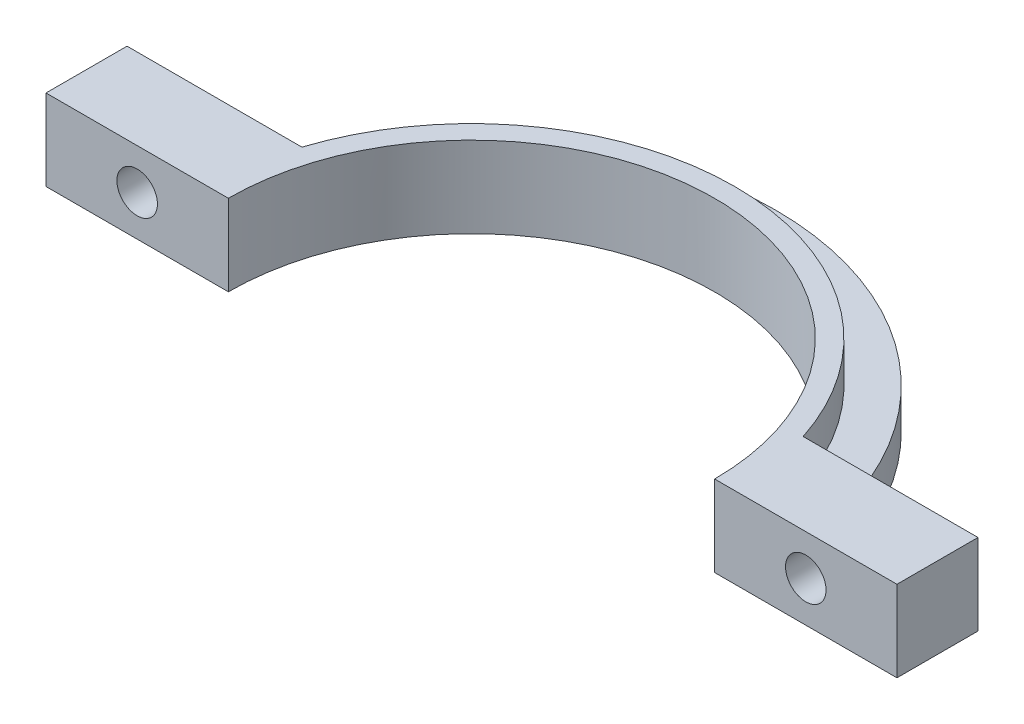
ISO-10303-21;
HEADER;
FILE_DESCRIPTION(('STEP AP214'),'2;1');
FILE_NAME('part.step','',(''),(''),'','','');
FILE_SCHEMA(('AUTOMOTIVE_DESIGN { 1 0 10303 214 1 1 1 1 }'));
ENDSEC;
DATA;
#1=APPLICATION_CONTEXT('core data for automotive mechanical design processes');
#2=APPLICATION_PROTOCOL_DEFINITION('international standard','automotive_design',2000,#1);
#3=PRODUCT_CONTEXT('',#1,'mechanical');
#4=PRODUCT('Part','Part','',(#3));
#5=PRODUCT_RELATED_PRODUCT_CATEGORY('part','',(#4));
#6=PRODUCT_DEFINITION_FORMATION('','',#4);
#7=PRODUCT_DEFINITION_CONTEXT('part definition',#1,'design');
#8=PRODUCT_DEFINITION('design','',#6,#7);
#9=PRODUCT_DEFINITION_SHAPE('','',#8);
#10=(LENGTH_UNIT() NAMED_UNIT(*) SI_UNIT(.MILLI.,.METRE.));
#11=(NAMED_UNIT(*) PLANE_ANGLE_UNIT() SI_UNIT($,.RADIAN.));
#12=(NAMED_UNIT(*) SI_UNIT($,.STERADIAN.) SOLID_ANGLE_UNIT());
#13=UNCERTAINTY_MEASURE_WITH_UNIT(LENGTH_MEASURE(1.E-05),#10,'distance_accuracy_value','');
#14=(GEOMETRIC_REPRESENTATION_CONTEXT(3) GLOBAL_UNCERTAINTY_ASSIGNED_CONTEXT((#13)) GLOBAL_UNIT_ASSIGNED_CONTEXT((#10,
#11,#12)) REPRESENTATION_CONTEXT('',''));
#15=CARTESIAN_POINT('',(0.,0.,0.));
#16=DIRECTION('',(0.,0.,1.));
#17=DIRECTION('',(1.,0.,0.));
#18=AXIS2_PLACEMENT_3D('',#15,#16,#17);
#19=CARTESIAN_POINT('',(0.,0.,0.));
#20=DIRECTION('',(0.,1.,0.));
#21=DIRECTION('',(0.,0.,1.));
#22=AXIS2_PLACEMENT_3D('',#19,#20,#21);
#23=PLANE('',#22);
#24=DIRECTION('',(-1.,0.,0.));
#25=VECTOR('',#24,1.);
#26=CARTESIAN_POINT('',(0.,0.,-9.99999999999999));
#27=LINE('',#26,#25);
#28=CARTESIAN_POINT('',(34.8064641982667,0.,-10.));
#29=VERTEX_POINT('',#28);
#30=CARTESIAN_POINT('',(28.2842712474619,0.,-10.));
#31=VERTEX_POINT('',#30);
#32=EDGE_CURVE('E191',#29,#31,#27,.T.);
#33=ORIENTED_EDGE('',*,*,#32,.F.);
#34=DIRECTION('',(0.,0.,1.));
#35=VECTOR('',#34,1.);
#36=CARTESIAN_POINT('',(34.8064641982667,0.,0.));
#37=LINE('',#36,#35);
#38=CARTESIAN_POINT('',(34.8064641982666,0.,-13.955645811455));
#39=VERTEX_POINT('',#38);
#40=EDGE_CURVE('E187',#39,#29,#37,.T.);
#41=ORIENTED_EDGE('',*,*,#40,.F.);
#42=CARTESIAN_POINT('',(0.,0.,0.));
#43=DIRECTION('',(0.,1.,0.));
#44=DIRECTION('',(0.,0.,1.));
#45=AXIS2_PLACEMENT_3D('',#42,#43,#44);
#46=CIRCLE('',#45,37.5);
#47=CARTESIAN_POINT('',(36.1420807370024,0.,-10.));
#48=VERTEX_POINT('',#47);
#49=EDGE_CURVE('E215',#48,#39,#46,.T.);
#50=ORIENTED_EDGE('',*,*,#49,.F.);
#51=DIRECTION('',(-1.,0.,0.));
#52=VECTOR('',#51,1.);
#53=CARTESIAN_POINT('',(0.,0.,-9.99999999999998));
#54=LINE('',#53,#52);
#55=CARTESIAN_POINT('',(52.5,0.,-10.));
#56=VERTEX_POINT('',#55);
#57=EDGE_CURVE('E289',#56,#48,#54,.T.);
#58=ORIENTED_EDGE('',*,*,#57,.F.);
#59=DIRECTION('',(0.,0.,-1.));
#60=VECTOR('',#59,1.);
#61=CARTESIAN_POINT('',(52.5,0.,0.));
#62=LINE('',#61,#60);
#63=CARTESIAN_POINT('',(52.5,0.,0.));
#64=VERTEX_POINT('',#63);
#65=EDGE_CURVE('E286',#64,#56,#62,.T.);
#66=ORIENTED_EDGE('',*,*,#65,.F.);
#67=DIRECTION('',(1.,0.,0.));
#68=VECTOR('',#67,1.);
#69=CARTESIAN_POINT('',(0.,0.,0.));
#70=LINE('',#69,#68);
#71=CARTESIAN_POINT('',(30.,0.,0.));
#72=VERTEX_POINT('',#71);
#73=EDGE_CURVE('E241',#72,#64,#70,.T.);
#74=ORIENTED_EDGE('',*,*,#73,.F.);
#75=CARTESIAN_POINT('',(0.,0.,0.));
#76=DIRECTION('',(0.,1.,0.));
#77=DIRECTION('',(0.,0.,1.));
#78=AXIS2_PLACEMENT_3D('',#75,#76,#77);
#79=CIRCLE('',#78,30.);
#80=EDGE_CURVE('E258',#72,#31,#79,.T.);
#81=ORIENTED_EDGE('',*,*,#80,.T.);
#82=EDGE_LOOP('',(#33,#41,#50,#58,#66,#74,#81));
#83=FACE_BOUND('',#82,.T.);
#84=ADVANCED_FACE('F51',(#83),#23,.F.);
#85=CARTESIAN_POINT('',(0.,10.,-9.99999999999998));
#86=DIRECTION('',(0.,0.,1.));
#87=DIRECTION('',(1.,0.,0.));
#88=AXIS2_PLACEMENT_3D('',#85,#86,#87);
#89=PLANE('',#88);
#90=CARTESIAN_POINT('',(41.25,5.,-10.));
#91=DIRECTION('',(0.,0.,1.));
#92=DIRECTION('',(1.,0.,0.));
#93=AXIS2_PLACEMENT_3D('',#90,#91,#92);
#94=CIRCLE('',#93,2.5);
#95=CARTESIAN_POINT('',(43.75,5.,-10.));
#96=VERTEX_POINT('',#95);
#97=EDGE_CURVE('E236',#96,#96,#94,.T.);
#98=ORIENTED_EDGE('',*,*,#97,.T.);
#99=EDGE_LOOP('',(#98));
#100=FACE_BOUND('',#99,.T.);
#101=DIRECTION('',(0.,-1.,0.));
#102=VECTOR('',#101,1.);
#103=CARTESIAN_POINT('',(36.1420807370024,5.,-10.));
#104=LINE('',#103,#102);
#105=CARTESIAN_POINT('',(36.1420807370024,5.,-10.));
#106=VERTEX_POINT('',#105);
#107=EDGE_CURVE('E225',#106,#48,#104,.T.);
#108=ORIENTED_EDGE('',*,*,#107,.F.);
#109=DIRECTION('',(-1.,0.,0.));
#110=VECTOR('',#109,1.);
#111=CARTESIAN_POINT('',(0.,5.,-9.99999999999998));
#112=LINE('',#111,#110);
#113=CARTESIAN_POINT('',(30.9232921921325,5.,-10.));
#114=VERTEX_POINT('',#113);
#115=EDGE_CURVE('E233',#106,#114,#112,.T.);
#116=ORIENTED_EDGE('',*,*,#115,.T.);
#117=DIRECTION('',(0.,-1.,0.));
#118=VECTOR('',#117,1.);
#119=CARTESIAN_POINT('',(30.9232921921325,10.,-10.));
#120=LINE('',#119,#118);
#121=CARTESIAN_POINT('',(30.9232921921325,10.,-10.));
#122=VERTEX_POINT('',#121);
#123=EDGE_CURVE('E323',#122,#114,#120,.T.);
#124=ORIENTED_EDGE('',*,*,#123,.F.);
#125=DIRECTION('',(-1.,0.,0.));
#126=VECTOR('',#125,1.);
#127=CARTESIAN_POINT('',(0.,10.,-9.99999999999998));
#128=LINE('',#127,#126);
#129=CARTESIAN_POINT('',(52.5,10.,-10.));
#130=VERTEX_POINT('',#129);
#131=EDGE_CURVE('E261',#130,#122,#128,.T.);
#132=ORIENTED_EDGE('',*,*,#131,.F.);
#133=DIRECTION('',(0.,-1.,0.));
#134=VECTOR('',#133,1.);
#135=CARTESIAN_POINT('',(52.5,10.,-10.));
#136=LINE('',#135,#134);
#137=EDGE_CURVE('E327',#130,#56,#136,.T.);
#138=ORIENTED_EDGE('',*,*,#137,.T.);
#139=ORIENTED_EDGE('',*,*,#57,.T.);
#140=EDGE_LOOP('',(#108,#116,#124,#132,#138,#139));
#141=FACE_BOUND('',#140,.T.);
#142=ADVANCED_FACE('F376',(#100,#141),#89,.F.);
#143=CARTESIAN_POINT('',(0.,10.,-10.));
#144=DIRECTION('',(0.,0.,-1.));
#145=DIRECTION('',(-1.,0.,0.));
#146=AXIS2_PLACEMENT_3D('',#143,#144,#145);
#147=PLANE('',#146);
#148=CARTESIAN_POINT('',(-41.25,5.,-10.));
#149=DIRECTION('',(0.,0.,1.));
#150=DIRECTION('',(1.,0.,0.));
#151=AXIS2_PLACEMENT_3D('',#148,#149,#150);
#152=CIRCLE('',#151,2.5);
#153=CARTESIAN_POINT('',(-38.75,5.,-10.));
#154=VERTEX_POINT('',#153);
#155=EDGE_CURVE('E237',#154,#154,#152,.T.);
#156=ORIENTED_EDGE('',*,*,#155,.T.);
#157=EDGE_LOOP('',(#156));
#158=FACE_BOUND('',#157,.T.);
#159=DIRECTION('',(1.,0.,0.));
#160=VECTOR('',#159,1.);
#161=CARTESIAN_POINT('',(0.,5.,-10.));
#162=LINE('',#161,#160);
#163=CARTESIAN_POINT('',(-36.1420807370024,5.,-10.));
#164=VERTEX_POINT('',#163);
#165=CARTESIAN_POINT('',(-30.9232921921325,5.,-10.));
#166=VERTEX_POINT('',#165);
#167=EDGE_CURVE('E229',#164,#166,#162,.T.);
#168=ORIENTED_EDGE('',*,*,#167,.F.);
#169=DIRECTION('',(0.,-1.,0.));
#170=VECTOR('',#169,1.);
#171=CARTESIAN_POINT('',(-36.1420807370024,5.,-10.));
#172=LINE('',#171,#170);
#173=CARTESIAN_POINT('',(-36.1420807370024,0.,-10.));
#174=VERTEX_POINT('',#173);
#175=EDGE_CURVE('E219',#164,#174,#172,.T.);
#176=ORIENTED_EDGE('',*,*,#175,.T.);
#177=DIRECTION('',(1.,0.,0.));
#178=VECTOR('',#177,1.);
#179=CARTESIAN_POINT('',(0.,0.,-10.));
#180=LINE('',#179,#178);
#181=CARTESIAN_POINT('',(-52.5,0.,-10.));
#182=VERTEX_POINT('',#181);
#183=EDGE_CURVE('E292',#182,#174,#180,.T.);
#184=ORIENTED_EDGE('',*,*,#183,.F.);
#185=DIRECTION('',(0.,-1.,0.));
#186=VECTOR('',#185,1.);
#187=CARTESIAN_POINT('',(-52.5,10.,-10.));
#188=LINE('',#187,#186);
#189=CARTESIAN_POINT('',(-52.5,10.,-10.));
#190=VERTEX_POINT('',#189);
#191=EDGE_CURVE('E316',#190,#182,#188,.T.);
#192=ORIENTED_EDGE('',*,*,#191,.F.);
#193=DIRECTION('',(1.,0.,0.));
#194=VECTOR('',#193,1.);
#195=CARTESIAN_POINT('',(0.,10.,-10.));
#196=LINE('',#195,#194);
#197=CARTESIAN_POINT('',(-30.9232921921325,10.,-10.));
#198=VERTEX_POINT('',#197);
#199=EDGE_CURVE('E267',#190,#198,#196,.T.);
#200=ORIENTED_EDGE('',*,*,#199,.T.);
#201=DIRECTION('',(0.,-1.,0.));
#202=VECTOR('',#201,1.);
#203=CARTESIAN_POINT('',(-30.9232921921325,10.,-10.));
#204=LINE('',#203,#202);
#205=EDGE_CURVE('E319',#198,#166,#204,.T.);
#206=ORIENTED_EDGE('',*,*,#205,.T.);
#207=EDGE_LOOP('',(#168,#176,#184,#192,#200,#206));
#208=FACE_BOUND('',#207,.T.);
#209=ADVANCED_FACE('F384',(#158,#208),#147,.T.);
#210=CARTESIAN_POINT('',(0.,10.,0.));
#211=DIRECTION('',(0.,0.,-1.));
#212=DIRECTION('',(-1.,0.,0.));
#213=AXIS2_PLACEMENT_3D('',#210,#211,#212);
#214=PLANE('',#213);
#215=CARTESIAN_POINT('',(41.25,5.,0.));
#216=DIRECTION('',(0.,0.,1.));
#217=DIRECTION('',(1.,0.,0.));
#218=AXIS2_PLACEMENT_3D('',#215,#216,#217);
#219=CIRCLE('',#218,2.5);
#220=CARTESIAN_POINT('',(43.75,5.,0.));
#221=VERTEX_POINT('',#220);
#222=EDGE_CURVE('E246',#221,#221,#219,.T.);
#223=ORIENTED_EDGE('',*,*,#222,.F.);
#224=EDGE_LOOP('',(#223));
#225=FACE_BOUND('',#224,.T.);
#226=ORIENTED_EDGE('',*,*,#73,.T.);
#227=DIRECTION('',(0.,-1.,0.));
#228=VECTOR('',#227,1.);
#229=CARTESIAN_POINT('',(52.5,10.,0.));
#230=LINE('',#229,#228);
#231=CARTESIAN_POINT('',(52.5,10.,0.));
#232=VERTEX_POINT('',#231);
#233=EDGE_CURVE('E331',#232,#64,#230,.T.);
#234=ORIENTED_EDGE('',*,*,#233,.F.);
#235=DIRECTION('',(1.,0.,0.));
#236=VECTOR('',#235,1.);
#237=CARTESIAN_POINT('',(0.,10.,0.));
#238=LINE('',#237,#236);
#239=CARTESIAN_POINT('',(30.,10.,0.));
#240=VERTEX_POINT('',#239);
#241=EDGE_CURVE('E253',#240,#232,#238,.T.);
#242=ORIENTED_EDGE('',*,*,#241,.F.);
#243=DIRECTION('',(0.,-1.,0.));
#244=VECTOR('',#243,1.);
#245=CARTESIAN_POINT('',(30.,10.,0.));
#246=LINE('',#245,#244);
#247=EDGE_CURVE('E283',#240,#72,#246,.T.);
#248=ORIENTED_EDGE('',*,*,#247,.T.);
#249=EDGE_LOOP('',(#226,#234,#242,#248));
#250=FACE_BOUND('',#249,.T.);
#251=ADVANCED_FACE('F480',(#225,#250),#214,.F.);
#252=CARTESIAN_POINT('',(52.5,10.,0.));
#253=DIRECTION('',(-1.,0.,0.));
#254=DIRECTION('',(0.,0.,1.));
#255=AXIS2_PLACEMENT_3D('',#252,#253,#254);
#256=PLANE('',#255);
#257=ORIENTED_EDGE('',*,*,#65,.T.);
#258=ORIENTED_EDGE('',*,*,#137,.F.);
#259=DIRECTION('',(0.,0.,-1.));
#260=VECTOR('',#259,1.);
#261=CARTESIAN_POINT('',(52.5,10.,0.));
#262=LINE('',#261,#260);
#263=EDGE_CURVE('E257',#232,#130,#262,.T.);
#264=ORIENTED_EDGE('',*,*,#263,.F.);
#265=ORIENTED_EDGE('',*,*,#233,.T.);
#266=EDGE_LOOP('',(#257,#258,#264,#265));
#267=FACE_BOUND('',#266,.T.);
#268=ADVANCED_FACE('F477',(#267),#256,.F.);
#269=CARTESIAN_POINT('',(0.,10.,0.));
#270=DIRECTION('',(0.,-1.,0.));
#271=DIRECTION('',(0.,0.,-1.));
#272=AXIS2_PLACEMENT_3D('',#269,#270,#271);
#273=CYLINDRICAL_SURFACE('',#272,32.5);
#274=ORIENTED_EDGE('',*,*,#123,.T.);
#275=CARTESIAN_POINT('',(0.,5.,0.));
#276=DIRECTION('',(0.,1.,0.));
#277=DIRECTION('',(0.,0.,1.));
#278=AXIS2_PLACEMENT_3D('',#275,#276,#277);
#279=CIRCLE('',#278,32.5);
#280=EDGE_CURVE('E211',#114,#166,#279,.T.);
#281=ORIENTED_EDGE('',*,*,#280,.T.);
#282=ORIENTED_EDGE('',*,*,#205,.F.);
#283=CARTESIAN_POINT('',(0.,10.,0.));
#284=DIRECTION('',(0.,1.,0.));
#285=DIRECTION('',(0.,0.,1.));
#286=AXIS2_PLACEMENT_3D('',#283,#284,#285);
#287=CIRCLE('',#286,32.5);
#288=EDGE_CURVE('E264',#122,#198,#287,.T.);
#289=ORIENTED_EDGE('',*,*,#288,.F.);
#290=EDGE_LOOP('',(#274,#281,#282,#289));
#291=FACE_BOUND('',#290,.T.);
#292=ADVANCED_FACE('F470',(#291),#273,.T.);
#293=CARTESIAN_POINT('',(-52.5,10.,0.));
#294=DIRECTION('',(-1.,0.,0.));
#295=DIRECTION('',(0.,0.,1.));
#296=AXIS2_PLACEMENT_3D('',#293,#294,#295);
#297=PLANE('',#296);
#298=DIRECTION('',(0.,0.,-1.));
#299=VECTOR('',#298,1.);
#300=CARTESIAN_POINT('',(-52.5,0.,0.));
#301=LINE('',#300,#299);
#302=CARTESIAN_POINT('',(-52.5,0.,0.));
#303=VERTEX_POINT('',#302);
#304=EDGE_CURVE('E295',#303,#182,#301,.T.);
#305=ORIENTED_EDGE('',*,*,#304,.F.);
#306=DIRECTION('',(0.,-1.,0.));
#307=VECTOR('',#306,1.);
#308=CARTESIAN_POINT('',(-52.5,10.,0.));
#309=LINE('',#308,#307);
#310=CARTESIAN_POINT('',(-52.5,10.,0.));
#311=VERTEX_POINT('',#310);
#312=EDGE_CURVE('E312',#311,#303,#309,.T.);
#313=ORIENTED_EDGE('',*,*,#312,.F.);
#314=DIRECTION('',(0.,0.,-1.));
#315=VECTOR('',#314,1.);
#316=CARTESIAN_POINT('',(-52.5,10.,0.));
#317=LINE('',#316,#315);
#318=EDGE_CURVE('E271',#311,#190,#317,.T.);
#319=ORIENTED_EDGE('',*,*,#318,.T.);
#320=ORIENTED_EDGE('',*,*,#191,.T.);
#321=EDGE_LOOP('',(#305,#313,#319,#320));
#322=FACE_BOUND('',#321,.T.);
#323=ADVANCED_FACE('F461',(#322),#297,.T.);
#324=CARTESIAN_POINT('',(0.,10.,0.));
#325=DIRECTION('',(0.,0.,1.));
#326=DIRECTION('',(1.,0.,0.));
#327=AXIS2_PLACEMENT_3D('',#324,#325,#326);
#328=PLANE('',#327);
#329=ORIENTED_EDGE('',*,*,#312,.T.);
#330=DIRECTION('',(-1.,0.,0.));
#331=VECTOR('',#330,1.);
#332=CARTESIAN_POINT('',(0.,0.,0.));
#333=LINE('',#332,#331);
#334=CARTESIAN_POINT('',(-30.,0.,0.));
#335=VERTEX_POINT('',#334);
#336=EDGE_CURVE('E299',#335,#303,#333,.T.);
#337=ORIENTED_EDGE('',*,*,#336,.F.);
#338=DIRECTION('',(0.,-1.,0.));
#339=VECTOR('',#338,1.);
#340=CARTESIAN_POINT('',(-30.,10.,0.));
#341=LINE('',#340,#339);
#342=CARTESIAN_POINT('',(-30.,10.,0.));
#343=VERTEX_POINT('',#342);
#344=EDGE_CURVE('E308',#343,#335,#341,.T.);
#345=ORIENTED_EDGE('',*,*,#344,.F.);
#346=DIRECTION('',(-1.,0.,0.));
#347=VECTOR('',#346,1.);
#348=CARTESIAN_POINT('',(0.,10.,0.));
#349=LINE('',#348,#347);
#350=EDGE_CURVE('E275',#343,#311,#349,.T.);
#351=ORIENTED_EDGE('',*,*,#350,.T.);
#352=EDGE_LOOP('',(#329,#337,#345,#351));
#353=FACE_BOUND('',#352,.T.);
#354=CARTESIAN_POINT('',(-41.25,5.,0.));
#355=DIRECTION('',(0.,0.,1.));
#356=DIRECTION('',(1.,0.,0.));
#357=AXIS2_PLACEMENT_3D('',#354,#355,#356);
#358=CIRCLE('',#357,2.5);
#359=CARTESIAN_POINT('',(-38.75,5.,0.));
#360=VERTEX_POINT('',#359);
#361=EDGE_CURVE('E242',#360,#360,#358,.T.);
#362=ORIENTED_EDGE('',*,*,#361,.F.);
#363=EDGE_LOOP('',(#362));
#364=FACE_BOUND('',#363,.T.);
#365=ADVANCED_FACE('F406',(#353,#364),#328,.T.);
#366=CARTESIAN_POINT('',(0.,10.,0.));
#367=DIRECTION('',(0.,-1.,0.));
#368=DIRECTION('',(0.,0.,-1.));
#369=AXIS2_PLACEMENT_3D('',#366,#367,#368);
#370=CYLINDRICAL_SURFACE('',#369,30.);
#371=ORIENTED_EDGE('',*,*,#80,.F.);
#372=ORIENTED_EDGE('',*,*,#247,.F.);
#373=CARTESIAN_POINT('',(0.,10.,0.));
#374=DIRECTION('',(0.,1.,0.));
#375=DIRECTION('',(0.,0.,1.));
#376=AXIS2_PLACEMENT_3D('',#373,#374,#375);
#377=CIRCLE('',#376,30.);
#378=EDGE_CURVE('E279',#240,#343,#377,.T.);
#379=ORIENTED_EDGE('',*,*,#378,.T.);
#380=ORIENTED_EDGE('',*,*,#344,.T.);
#381=EDGE_CURVE('E302',#31,#335,#79,.T.);
#382=ORIENTED_EDGE('',*,*,#381,.F.);
#383=EDGE_LOOP('',(#371,#372,#379,#380,#382));
#384=FACE_BOUND('',#383,.T.);
#385=ADVANCED_FACE('F401',(#384),#370,.F.);
#386=CARTESIAN_POINT('',(0.,10.,0.));
#387=DIRECTION('',(0.,1.,0.));
#388=DIRECTION('',(0.,0.,1.));
#389=AXIS2_PLACEMENT_3D('',#386,#387,#388);
#390=PLANE('',#389);
#391=ORIENTED_EDGE('',*,*,#241,.T.);
#392=ORIENTED_EDGE('',*,*,#263,.T.);
#393=ORIENTED_EDGE('',*,*,#131,.T.);
#394=ORIENTED_EDGE('',*,*,#288,.T.);
#395=ORIENTED_EDGE('',*,*,#199,.F.);
#396=ORIENTED_EDGE('',*,*,#318,.F.);
#397=ORIENTED_EDGE('',*,*,#350,.F.);
#398=ORIENTED_EDGE('',*,*,#378,.F.);
#399=EDGE_LOOP('',(#391,#392,#393,#394,#395,#396,#397,#398));
#400=FACE_BOUND('',#399,.T.);
#401=ADVANCED_FACE('F392',(#400),#390,.T.);
#402=EDGE_CURVE('E184',#39,#174,#46,.T.);
#403=ORIENTED_EDGE('',*,*,#402,.F.);
#404=DIRECTION('',(-1.,0.,0.));
#405=VECTOR('',#404,1.);
#406=CARTESIAN_POINT('',(0.,0.,-13.955645811455));
#407=LINE('',#406,#405);
#408=CARTESIAN_POINT('',(28.2842712474619,0.,-13.955645811455));
#409=VERTEX_POINT('',#408);
#410=EDGE_CURVE('E170',#39,#409,#407,.T.);
#411=ORIENTED_EDGE('',*,*,#410,.T.);
#412=DIRECTION('',(0.,0.,-1.));
#413=VECTOR('',#412,1.);
#414=CARTESIAN_POINT('',(28.2842712474619,0.,0.));
#415=LINE('',#414,#413);
#416=EDGE_CURVE('E181',#31,#409,#415,.T.);
#417=ORIENTED_EDGE('',*,*,#416,.F.);
#418=ORIENTED_EDGE('',*,*,#381,.T.);
#419=ORIENTED_EDGE('',*,*,#336,.T.);
#420=ORIENTED_EDGE('',*,*,#304,.T.);
#421=ORIENTED_EDGE('',*,*,#183,.T.);
#422=EDGE_LOOP('',(#403,#411,#417,#418,#419,#420,#421));
#423=FACE_BOUND('',#422,.T.);
#424=ADVANCED_FACE('F180',(#423),#23,.F.);
#425=CARTESIAN_POINT('',(-41.25,5.,-10.));
#426=DIRECTION('',(0.,0.,1.));
#427=DIRECTION('',(1.,0.,0.));
#428=AXIS2_PLACEMENT_3D('',#425,#426,#427);
#429=CYLINDRICAL_SURFACE('',#428,2.5);
#430=ORIENTED_EDGE('',*,*,#155,.F.);
#431=EDGE_LOOP('',(#430));
#432=FACE_BOUND('',#431,.T.);
#433=ORIENTED_EDGE('',*,*,#361,.T.);
#434=EDGE_LOOP('',(#433));
#435=FACE_BOUND('',#434,.T.);
#436=ADVANCED_FACE('F391',(#432,#435),#429,.F.);
#437=CARTESIAN_POINT('',(41.25,5.,-10.));
#438=DIRECTION('',(0.,0.,1.));
#439=DIRECTION('',(1.,0.,0.));
#440=AXIS2_PLACEMENT_3D('',#437,#438,#439);
#441=CYLINDRICAL_SURFACE('',#440,2.5);
#442=ORIENTED_EDGE('',*,*,#97,.F.);
#443=EDGE_LOOP('',(#442));
#444=FACE_BOUND('',#443,.T.);
#445=ORIENTED_EDGE('',*,*,#222,.T.);
#446=EDGE_LOOP('',(#445));
#447=FACE_BOUND('',#446,.T.);
#448=ADVANCED_FACE('F397',(#444,#447),#441,.F.);
#449=CARTESIAN_POINT('',(0.,5.,0.));
#450=DIRECTION('',(0.,1.,0.));
#451=DIRECTION('',(0.,0.,1.));
#452=AXIS2_PLACEMENT_3D('',#449,#450,#451);
#453=PLANE('',#452);
#454=ORIENTED_EDGE('',*,*,#115,.F.);
#455=CARTESIAN_POINT('',(0.,5.,0.));
#456=DIRECTION('',(0.,1.,0.));
#457=DIRECTION('',(0.,0.,1.));
#458=AXIS2_PLACEMENT_3D('',#455,#456,#457);
#459=CIRCLE('',#458,37.5);
#460=EDGE_CURVE('E214',#106,#164,#459,.T.);
#461=ORIENTED_EDGE('',*,*,#460,.T.);
#462=ORIENTED_EDGE('',*,*,#167,.T.);
#463=ORIENTED_EDGE('',*,*,#280,.F.);
#464=EDGE_LOOP('',(#454,#461,#462,#463));
#465=FACE_BOUND('',#464,.T.);
#466=ADVANCED_FACE('F410',(#465),#453,.T.);
#467=CARTESIAN_POINT('',(0.,5.,0.));
#468=DIRECTION('',(0.,-1.,0.));
#469=DIRECTION('',(0.,0.,-1.));
#470=AXIS2_PLACEMENT_3D('',#467,#468,#469);
#471=CYLINDRICAL_SURFACE('',#470,37.5);
#472=ORIENTED_EDGE('',*,*,#460,.F.);
#473=ORIENTED_EDGE('',*,*,#107,.T.);
#474=ORIENTED_EDGE('',*,*,#49,.T.);
#475=ORIENTED_EDGE('',*,*,#402,.T.);
#476=ORIENTED_EDGE('',*,*,#175,.F.);
#477=EDGE_LOOP('',(#472,#473,#474,#475,#476));
#478=FACE_BOUND('',#477,.T.);
#479=ADVANCED_FACE('F413',(#478),#471,.T.);
#480=CARTESIAN_POINT('',(0.,-10.,-9.99999999999999));
#481=DIRECTION('',(0.,0.,-1.));
#482=DIRECTION('',(-1.,0.,0.));
#483=AXIS2_PLACEMENT_3D('',#480,#481,#482);
#484=PLANE('',#483);
#485=CARTESIAN_POINT('',(31.5453677228643,-6.,-10.));
#486=DIRECTION('',(0.,0.,-1.));
#487=DIRECTION('',(-1.,0.,0.));
#488=AXIS2_PLACEMENT_3D('',#485,#486,#487);
#489=CIRCLE('',#488,2.);
#490=CARTESIAN_POINT('',(29.5453677228643,-6.,-10.));
#491=VERTEX_POINT('',#490);
#492=EDGE_CURVE('E195',#491,#491,#489,.T.);
#493=ORIENTED_EDGE('',*,*,#492,.T.);
#494=EDGE_LOOP('',(#493));
#495=FACE_BOUND('',#494,.T.);
#496=DIRECTION('',(0.,1.,0.));
#497=VECTOR('',#496,1.);
#498=CARTESIAN_POINT('',(28.2842712474619,-10.,-10.));
#499=LINE('',#498,#497);
#500=CARTESIAN_POINT('',(28.2842712474619,-9.,-10.));
#501=VERTEX_POINT('',#500);
#502=EDGE_CURVE('E174',#501,#31,#499,.T.);
#503=ORIENTED_EDGE('',*,*,#502,.F.);
#504=DIRECTION('',(0.707106781186548,-0.707106781186548,0.));
#505=VECTOR('',#504,1.);
#506=CARTESIAN_POINT('',(29.2842712474619,-10.,-10.));
#507=LINE('',#506,#505);
#508=CARTESIAN_POINT('',(29.2842712474619,-10.,-10.));
#509=VERTEX_POINT('',#508);
#510=EDGE_CURVE('E61',#501,#509,#507,.T.);
#511=ORIENTED_EDGE('',*,*,#510,.T.);
#512=DIRECTION('',(-1.,0.,0.));
#513=VECTOR('',#512,1.);
#514=CARTESIAN_POINT('',(0.,-10.,-9.99999999999999));
#515=LINE('',#514,#513);
#516=CARTESIAN_POINT('',(33.8064641982667,-10.,-10.));
#517=VERTEX_POINT('',#516);
#518=EDGE_CURVE('E202',#517,#509,#515,.T.);
#519=ORIENTED_EDGE('',*,*,#518,.F.);
#520=DIRECTION('',(0.707106781186543,0.707106781186552,0.));
#521=VECTOR('',#520,1.);
#522=CARTESIAN_POINT('',(33.8064641982667,-10.,-10.));
#523=LINE('',#522,#521);
#524=CARTESIAN_POINT('',(34.8064641982667,-8.99999999999999,-10.));
#525=VERTEX_POINT('',#524);
#526=EDGE_CURVE('E68',#517,#525,#523,.T.);
#527=ORIENTED_EDGE('',*,*,#526,.T.);
#528=DIRECTION('',(0.,1.,0.));
#529=VECTOR('',#528,1.);
#530=CARTESIAN_POINT('',(34.8064641982667,-10.,-10.));
#531=LINE('',#530,#529);
#532=EDGE_CURVE('E203',#525,#29,#531,.T.);
#533=ORIENTED_EDGE('',*,*,#532,.T.);
#534=ORIENTED_EDGE('',*,*,#32,.T.);
#535=EDGE_LOOP('',(#503,#511,#519,#527,#533,#534));
#536=FACE_BOUND('',#535,.T.);
#537=ADVANCED_FACE('F354',(#495,#536),#484,.F.);
#538=CARTESIAN_POINT('',(28.2842712474619,-10.,0.));
#539=DIRECTION('',(1.,0.,0.));
#540=DIRECTION('',(0.,0.,-1.));
#541=AXIS2_PLACEMENT_3D('',#538,#539,#540);
#542=PLANE('',#541);
#543=DIRECTION('',(0.,1.,0.));
#544=VECTOR('',#543,1.);
#545=CARTESIAN_POINT('',(28.2842712474619,-10.,-13.955645811455));
#546=LINE('',#545,#544);
#547=CARTESIAN_POINT('',(28.2842712474619,-9.,-13.955645811455));
#548=VERTEX_POINT('',#547);
#549=EDGE_CURVE('E165',#548,#409,#546,.T.);
#550=ORIENTED_EDGE('',*,*,#549,.F.);
#551=DIRECTION('',(0.,0.,1.));
#552=VECTOR('',#551,1.);
#553=CARTESIAN_POINT('',(28.2842712474619,-9.,-10.));
#554=LINE('',#553,#552);
#555=EDGE_CURVE('E76',#548,#501,#554,.T.);
#556=ORIENTED_EDGE('',*,*,#555,.T.);
#557=ORIENTED_EDGE('',*,*,#502,.T.);
#558=ORIENTED_EDGE('',*,*,#416,.T.);
#559=EDGE_LOOP('',(#550,#556,#557,#558));
#560=FACE_BOUND('',#559,.T.);
#561=ADVANCED_FACE('F189',(#560),#542,.F.);
#562=CARTESIAN_POINT('',(0.,-10.,-13.955645811455));
#563=DIRECTION('',(0.,0.,-1.));
#564=DIRECTION('',(-1.,0.,0.));
#565=AXIS2_PLACEMENT_3D('',#562,#563,#564);
#566=PLANE('',#565);
#567=CARTESIAN_POINT('',(31.5453677228643,-6.,-13.955645811455));
#568=DIRECTION('',(0.,0.,-1.));
#569=DIRECTION('',(-1.,0.,0.));
#570=AXIS2_PLACEMENT_3D('',#567,#568,#569);
#571=CIRCLE('',#570,2.);
#572=CARTESIAN_POINT('',(29.5453677228643,-6.,-13.955645811455));
#573=VERTEX_POINT('',#572);
#574=EDGE_CURVE('E436',#573,#573,#571,.T.);
#575=ORIENTED_EDGE('',*,*,#574,.F.);
#576=EDGE_LOOP('',(#575));
#577=FACE_BOUND('',#576,.T.);
#578=DIRECTION('',(-1.,0.,0.));
#579=VECTOR('',#578,1.);
#580=CARTESIAN_POINT('',(0.,-10.,-13.955645811455));
#581=LINE('',#580,#579);
#582=CARTESIAN_POINT('',(33.8064641982667,-10.,-13.955645811455));
#583=VERTEX_POINT('',#582);
#584=CARTESIAN_POINT('',(29.2842712474619,-10.,-13.955645811455));
#585=VERTEX_POINT('',#584);
#586=EDGE_CURVE('E206',#583,#585,#581,.T.);
#587=ORIENTED_EDGE('',*,*,#586,.T.);
#588=DIRECTION('',(-0.707106781186548,0.707106781186548,0.));
#589=VECTOR('',#588,1.);
#590=CARTESIAN_POINT('',(14.6421356237309,4.64213562373095,-13.955645811455));
#591=LINE('',#590,#589);
#592=EDGE_CURVE('E171',#585,#548,#591,.T.);
#593=ORIENTED_EDGE('',*,*,#592,.T.);
#594=ORIENTED_EDGE('',*,*,#549,.T.);
#595=ORIENTED_EDGE('',*,*,#410,.F.);
#596=DIRECTION('',(0.,1.,0.));
#597=VECTOR('',#596,1.);
#598=CARTESIAN_POINT('',(34.8064641982666,-10.,-13.955645811455));
#599=LINE('',#598,#597);
#600=CARTESIAN_POINT('',(34.8064641982666,-8.99999999999999,-13.955645811455));
#601=VERTEX_POINT('',#600);
#602=EDGE_CURVE('E175',#601,#39,#599,.T.);
#603=ORIENTED_EDGE('',*,*,#602,.F.);
#604=DIRECTION('',(-0.707106781186543,-0.707106781186552,0.));
#605=VECTOR('',#604,1.);
#606=CARTESIAN_POINT('',(16.9032320991336,-26.9032320991333,-13.955645811455));
#607=LINE('',#606,#605);
#608=EDGE_CURVE('E343',#601,#583,#607,.T.);
#609=ORIENTED_EDGE('',*,*,#608,.T.);
#610=EDGE_LOOP('',(#587,#593,#594,#595,#603,#609));
#611=FACE_BOUND('',#610,.T.);
#612=ADVANCED_FACE('F168',(#577,#611),#566,.T.);
#613=CARTESIAN_POINT('',(34.8064641982667,-10.,0.));
#614=DIRECTION('',(-1.,0.,0.));
#615=DIRECTION('',(0.,0.,1.));
#616=AXIS2_PLACEMENT_3D('',#613,#614,#615);
#617=PLANE('',#616);
#618=ORIENTED_EDGE('',*,*,#532,.F.);
#619=DIRECTION('',(0.,0.,-1.));
#620=VECTOR('',#619,1.);
#621=CARTESIAN_POINT('',(34.8064641982667,-8.99999999999999,-13.955645811455));
#622=LINE('',#621,#620);
#623=EDGE_CURVE('E11',#525,#601,#622,.T.);
#624=ORIENTED_EDGE('',*,*,#623,.T.);
#625=ORIENTED_EDGE('',*,*,#602,.T.);
#626=ORIENTED_EDGE('',*,*,#40,.T.);
#627=EDGE_LOOP('',(#618,#624,#625,#626));
#628=FACE_BOUND('',#627,.T.);
#629=ADVANCED_FACE('F371',(#628),#617,.F.);
#630=CARTESIAN_POINT('',(0.,-10.,0.));
#631=DIRECTION('',(0.,-1.,0.));
#632=DIRECTION('',(0.,0.,-1.));
#633=AXIS2_PLACEMENT_3D('',#630,#631,#632);
#634=PLANE('',#633);
#635=ORIENTED_EDGE('',*,*,#518,.T.);
#636=DIRECTION('',(0.,0.,-1.));
#637=VECTOR('',#636,1.);
#638=CARTESIAN_POINT('',(29.2842712474619,-10.,-13.955645811455));
#639=LINE('',#638,#637);
#640=EDGE_CURVE('E339',#509,#585,#639,.T.);
#641=ORIENTED_EDGE('',*,*,#640,.T.);
#642=ORIENTED_EDGE('',*,*,#586,.F.);
#643=DIRECTION('',(0.,0.,1.));
#644=VECTOR('',#643,1.);
#645=CARTESIAN_POINT('',(33.8064641982667,-10.,-10.));
#646=LINE('',#645,#644);
#647=EDGE_CURVE('E335',#583,#517,#646,.T.);
#648=ORIENTED_EDGE('',*,*,#647,.T.);
#649=EDGE_LOOP('',(#635,#641,#642,#648));
#650=FACE_BOUND('',#649,.T.);
#651=ADVANCED_FACE('F358',(#650),#634,.T.);
#652=CARTESIAN_POINT('',(29.2842712474619,-10.,0.));
#653=DIRECTION('',(-0.707106781186547,-0.707106781186547,0.));
#654=DIRECTION('',(0.,0.,1.));
#655=AXIS2_PLACEMENT_3D('',#652,#653,#654);
#656=PLANE('',#655);
#657=ORIENTED_EDGE('',*,*,#510,.F.);
#658=ORIENTED_EDGE('',*,*,#555,.F.);
#659=ORIENTED_EDGE('',*,*,#592,.F.);
#660=ORIENTED_EDGE('',*,*,#640,.F.);
#661=EDGE_LOOP('',(#657,#658,#659,#660));
#662=FACE_BOUND('',#661,.T.);
#663=ADVANCED_FACE('F363',(#662),#656,.T.);
#664=CARTESIAN_POINT('',(33.8064641982667,-10.,0.));
#665=DIRECTION('',(0.707106781186552,-0.707106781186542,0.));
#666=DIRECTION('',(0.,0.,-1.));
#667=AXIS2_PLACEMENT_3D('',#664,#665,#666);
#668=PLANE('',#667);
#669=ORIENTED_EDGE('',*,*,#608,.F.);
#670=ORIENTED_EDGE('',*,*,#623,.F.);
#671=ORIENTED_EDGE('',*,*,#526,.F.);
#672=ORIENTED_EDGE('',*,*,#647,.F.);
#673=EDGE_LOOP('',(#669,#670,#671,#672));
#674=FACE_BOUND('',#673,.T.);
#675=ADVANCED_FACE('F54',(#674),#668,.T.);
#676=CARTESIAN_POINT('',(31.5453677228643,-6.,-3.95564581145504));
#677=DIRECTION('',(0.,0.,-1.));
#678=DIRECTION('',(-1.,0.,0.));
#679=AXIS2_PLACEMENT_3D('',#676,#677,#678);
#680=CYLINDRICAL_SURFACE('',#679,2.);
#681=ORIENTED_EDGE('',*,*,#574,.T.);
#682=EDGE_LOOP('',(#681));
#683=FACE_BOUND('',#682,.T.);
#684=ORIENTED_EDGE('',*,*,#492,.F.);
#685=EDGE_LOOP('',(#684));
#686=FACE_BOUND('',#685,.T.);
#687=ADVANCED_FACE('F369',(#683,#686),#680,.F.);
#688=CLOSED_SHELL('',(#84,#142,#209,#251,#268,#292,#323,#365,#385,#401,#424,#436,#448,#466,#479,
#537,#561,#612,#629,#651,#663,#675,#687));
#689=MANIFOLD_SOLID_BREP('B2',#688);
#690=ADVANCED_BREP_SHAPE_REPRESENTATION('',(#18,#689),#14);
#691=SHAPE_DEFINITION_REPRESENTATION(#9,#690);
ENDSEC;
END-ISO-10303-21;
